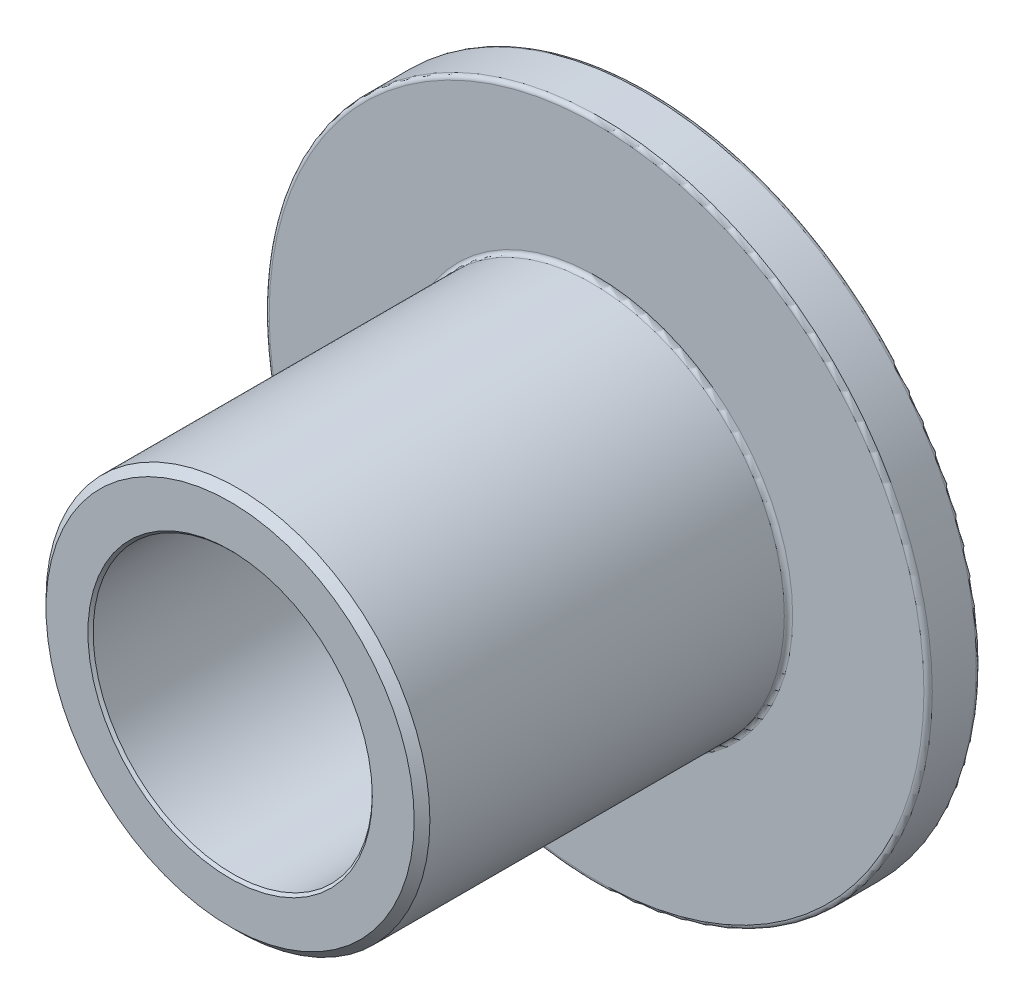
ISO-10303-21;
HEADER;
FILE_DESCRIPTION(('STEP AP214'),'2;1');
FILE_NAME('part.step','',(''),(''),'','','');
FILE_SCHEMA(('AUTOMOTIVE_DESIGN { 1 0 10303 214 1 1 1 1 }'));
ENDSEC;
DATA;
#1=APPLICATION_CONTEXT('core data for automotive mechanical design processes');
#2=APPLICATION_PROTOCOL_DEFINITION('international standard','automotive_design',2000,#1);
#3=PRODUCT_CONTEXT('',#1,'mechanical');
#4=PRODUCT('Part','Part','',(#3));
#5=PRODUCT_RELATED_PRODUCT_CATEGORY('part','',(#4));
#6=PRODUCT_DEFINITION_FORMATION('','',#4);
#7=PRODUCT_DEFINITION_CONTEXT('part definition',#1,'design');
#8=PRODUCT_DEFINITION('design','',#6,#7);
#9=PRODUCT_DEFINITION_SHAPE('','',#8);
#10=(LENGTH_UNIT() NAMED_UNIT(*) SI_UNIT(.MILLI.,.METRE.));
#11=(NAMED_UNIT(*) PLANE_ANGLE_UNIT() SI_UNIT($,.RADIAN.));
#12=(NAMED_UNIT(*) SI_UNIT($,.STERADIAN.) SOLID_ANGLE_UNIT());
#13=UNCERTAINTY_MEASURE_WITH_UNIT(LENGTH_MEASURE(1.E-05),#10,'distance_accuracy_value','');
#14=(GEOMETRIC_REPRESENTATION_CONTEXT(3) GLOBAL_UNCERTAINTY_ASSIGNED_CONTEXT((#13)) GLOBAL_UNIT_ASSIGNED_CONTEXT((#10,
#11,#12)) REPRESENTATION_CONTEXT('',''));
#15=CARTESIAN_POINT('',(0.,0.,0.));
#16=DIRECTION('',(0.,0.,1.));
#17=DIRECTION('',(1.,0.,0.));
#18=AXIS2_PLACEMENT_3D('',#15,#16,#17);
#19=CARTESIAN_POINT('',(0.,-2.,-3.));
#20=DIRECTION('',(0.,0.,-1.));
#21=DIRECTION('',(-1.,0.,0.));
#22=AXIS2_PLACEMENT_3D('',#19,#20,#21);
#23=PLANE('',#22);
#24=CARTESIAN_POINT('',(0.,0.,-3.));
#25=DIRECTION('',(0.,0.,-1.));
#26=DIRECTION('',(-1.,0.,0.));
#27=AXIS2_PLACEMENT_3D('',#24,#25,#26);
#28=CIRCLE('',#27,4.69);
#29=CARTESIAN_POINT('',(-4.69,0.,-3.));
#30=VERTEX_POINT('',#29);
#31=EDGE_CURVE('E47',#30,#30,#28,.T.);
#32=ORIENTED_EDGE('',*,*,#31,.T.);
#33=EDGE_LOOP('',(#32));
#34=FACE_BOUND('',#33,.T.);
#35=CARTESIAN_POINT('',(0.,0.,-3.));
#36=DIRECTION('',(0.,0.,-1.));
#37=DIRECTION('',(-1.,0.,0.));
#38=AXIS2_PLACEMENT_3D('',#35,#36,#37);
#39=CIRCLE('',#38,2.0375);
#40=CARTESIAN_POINT('',(-2.0375,0.,-3.));
#41=VERTEX_POINT('',#40);
#42=EDGE_CURVE('E67',#41,#41,#39,.F.);
#43=ORIENTED_EDGE('',*,*,#42,.T.);
#44=EDGE_LOOP('',(#43));
#45=FACE_BOUND('',#44,.T.);
#46=ADVANCED_FACE('F32',(#34,#45),#23,.T.);
#47=CARTESIAN_POINT('',(0.,0.,3.));
#48=DIRECTION('',(0.,0.,1.));
#49=DIRECTION('',(1.,0.,0.));
#50=AXIS2_PLACEMENT_3D('',#47,#48,#49);
#51=CYLINDRICAL_SURFACE('',#50,4.75);
#52=CARTESIAN_POINT('',(0.,0.,-2.94));
#53=DIRECTION('',(0.,0.,-1.));
#54=DIRECTION('',(-1.,0.,0.));
#55=AXIS2_PLACEMENT_3D('',#52,#53,#54);
#56=CIRCLE('',#55,4.75);
#57=CARTESIAN_POINT('',(-4.75,0.,-2.94));
#58=VERTEX_POINT('',#57);
#59=EDGE_CURVE('E52',#58,#58,#56,.F.);
#60=ORIENTED_EDGE('',*,*,#59,.T.);
#61=EDGE_LOOP('',(#60));
#62=FACE_BOUND('',#61,.T.);
#63=CARTESIAN_POINT('',(0.,0.,-2.31));
#64=DIRECTION('',(0.,0.,1.));
#65=DIRECTION('',(1.,0.,0.));
#66=AXIS2_PLACEMENT_3D('',#63,#64,#65);
#67=CIRCLE('',#66,4.75);
#68=CARTESIAN_POINT('',(4.75,0.,-2.31));
#69=VERTEX_POINT('',#68);
#70=EDGE_CURVE('E55',#69,#69,#67,.F.);
#71=ORIENTED_EDGE('',*,*,#70,.T.);
#72=EDGE_LOOP('',(#71));
#73=FACE_BOUND('',#72,.T.);
#74=ADVANCED_FACE('F97',(#62,#73),#51,.T.);
#75=CARTESIAN_POINT('',(0.,-4.75,-2.25));
#76=DIRECTION('',(0.,0.,1.));
#77=DIRECTION('',(1.,0.,0.));
#78=AXIS2_PLACEMENT_3D('',#75,#76,#77);
#79=PLANE('',#78);
#80=CARTESIAN_POINT('',(0.,0.,-2.25));
#81=DIRECTION('',(0.,0.,1.));
#82=DIRECTION('',(1.,0.,0.));
#83=AXIS2_PLACEMENT_3D('',#80,#81,#82);
#84=CIRCLE('',#83,2.81);
#85=CARTESIAN_POINT('',(2.81,0.,-2.25));
#86=VERTEX_POINT('',#85);
#87=EDGE_CURVE('E10',#86,#86,#84,.F.);
#88=ORIENTED_EDGE('',*,*,#87,.T.);
#89=EDGE_LOOP('',(#88));
#90=FACE_BOUND('',#89,.T.);
#91=CARTESIAN_POINT('',(0.,0.,-2.25));
#92=DIRECTION('',(0.,0.,1.));
#93=DIRECTION('',(1.,0.,0.));
#94=AXIS2_PLACEMENT_3D('',#91,#92,#93);
#95=CIRCLE('',#94,4.69);
#96=CARTESIAN_POINT('',(4.69,0.,-2.25));
#97=VERTEX_POINT('',#96);
#98=EDGE_CURVE('E39',#97,#97,#95,.T.);
#99=ORIENTED_EDGE('',*,*,#98,.T.);
#100=EDGE_LOOP('',(#99));
#101=FACE_BOUND('',#100,.T.);
#102=ADVANCED_FACE('F102',(#90,#101),#79,.T.);
#103=CARTESIAN_POINT('',(0.,0.,3.));
#104=DIRECTION('',(0.,0.,1.));
#105=DIRECTION('',(1.,0.,0.));
#106=AXIS2_PLACEMENT_3D('',#103,#104,#105);
#107=CYLINDRICAL_SURFACE('',#106,2.75);
#108=CARTESIAN_POINT('',(0.,0.,-2.19));
#109=DIRECTION('',(0.,0.,1.));
#110=DIRECTION('',(1.,0.,0.));
#111=AXIS2_PLACEMENT_3D('',#108,#109,#110);
#112=CIRCLE('',#111,2.75);
#113=CARTESIAN_POINT('',(2.75,0.,-2.19));
#114=VERTEX_POINT('',#113);
#115=EDGE_CURVE('E43',#114,#114,#112,.T.);
#116=ORIENTED_EDGE('',*,*,#115,.T.);
#117=EDGE_LOOP('',(#116));
#118=FACE_BOUND('',#117,.T.);
#119=CARTESIAN_POINT('',(0.,0.,2.8875));
#120=DIRECTION('',(0.,0.,1.));
#121=DIRECTION('',(1.,0.,0.));
#122=AXIS2_PLACEMENT_3D('',#119,#120,#121);
#123=CIRCLE('',#122,2.75);
#124=CARTESIAN_POINT('',(2.75,0.,2.8875));
#125=VERTEX_POINT('',#124);
#126=EDGE_CURVE('E70',#125,#125,#123,.F.);
#127=ORIENTED_EDGE('',*,*,#126,.T.);
#128=EDGE_LOOP('',(#127));
#129=FACE_BOUND('',#128,.T.);
#130=ADVANCED_FACE('F109',(#118,#129),#107,.T.);
#131=CARTESIAN_POINT('',(0.,-2.75,3.));
#132=DIRECTION('',(0.,0.,1.));
#133=DIRECTION('',(1.,0.,0.));
#134=AXIS2_PLACEMENT_3D('',#131,#132,#133);
#135=PLANE('',#134);
#136=CARTESIAN_POINT('',(0.,0.,3.));
#137=DIRECTION('',(0.,0.,1.));
#138=DIRECTION('',(1.,0.,0.));
#139=AXIS2_PLACEMENT_3D('',#136,#137,#138);
#140=CIRCLE('',#139,2.0375);
#141=CARTESIAN_POINT('',(2.0375,0.,3.));
#142=VERTEX_POINT('',#141);
#143=EDGE_CURVE('E58',#142,#142,#140,.F.);
#144=ORIENTED_EDGE('',*,*,#143,.T.);
#145=EDGE_LOOP('',(#144));
#146=FACE_BOUND('',#145,.T.);
#147=CARTESIAN_POINT('',(0.,0.,3.));
#148=DIRECTION('',(0.,0.,1.));
#149=DIRECTION('',(1.,0.,0.));
#150=AXIS2_PLACEMENT_3D('',#147,#148,#149);
#151=CIRCLE('',#150,2.6375);
#152=CARTESIAN_POINT('',(2.6375,0.,3.));
#153=VERTEX_POINT('',#152);
#154=EDGE_CURVE('E73',#153,#153,#151,.T.);
#155=ORIENTED_EDGE('',*,*,#154,.T.);
#156=EDGE_LOOP('',(#155));
#157=FACE_BOUND('',#156,.T.);
#158=ADVANCED_FACE('F77',(#146,#157),#135,.T.);
#159=CARTESIAN_POINT('',(0.,0.,3.));
#160=DIRECTION('',(0.,0.,1.));
#161=DIRECTION('',(1.,0.,0.));
#162=AXIS2_PLACEMENT_3D('',#159,#160,#161);
#163=CYLINDRICAL_SURFACE('',#162,2.);
#164=CARTESIAN_POINT('',(0.,0.,-2.9625));
#165=DIRECTION('',(0.,0.,-1.));
#166=DIRECTION('',(-1.,0.,0.));
#167=AXIS2_PLACEMENT_3D('',#164,#165,#166);
#168=CIRCLE('',#167,2.);
#169=CARTESIAN_POINT('',(-2.,0.,-2.9625));
#170=VERTEX_POINT('',#169);
#171=EDGE_CURVE('E61',#170,#170,#168,.T.);
#172=ORIENTED_EDGE('',*,*,#171,.T.);
#173=EDGE_LOOP('',(#172));
#174=FACE_BOUND('',#173,.T.);
#175=CARTESIAN_POINT('',(0.,0.,2.9625));
#176=DIRECTION('',(0.,0.,1.));
#177=DIRECTION('',(1.,0.,0.));
#178=AXIS2_PLACEMENT_3D('',#175,#176,#177);
#179=CIRCLE('',#178,2.);
#180=CARTESIAN_POINT('',(2.,0.,2.9625));
#181=VERTEX_POINT('',#180);
#182=EDGE_CURVE('E64',#181,#181,#179,.T.);
#183=ORIENTED_EDGE('',*,*,#182,.T.);
#184=EDGE_LOOP('',(#183));
#185=FACE_BOUND('',#184,.T.);
#186=ADVANCED_FACE('F82',(#174,#185),#163,.F.);
#187=CARTESIAN_POINT('',(0.,0.,3.));
#188=DIRECTION('',(0.,0.,-1.));
#189=DIRECTION('',(-1.,0.,0.));
#190=AXIS2_PLACEMENT_3D('',#187,#188,#189);
#191=CONICAL_SURFACE('',#190,2.6375,0.785398163397448);
#192=ORIENTED_EDGE('',*,*,#126,.F.);
#193=EDGE_LOOP('',(#192));
#194=FACE_BOUND('',#193,.T.);
#195=ORIENTED_EDGE('',*,*,#154,.F.);
#196=EDGE_LOOP('',(#195));
#197=FACE_BOUND('',#196,.T.);
#198=ADVANCED_FACE('F79',(#194,#197),#191,.T.);
#199=CARTESIAN_POINT('',(0.,0.,-3.));
#200=DIRECTION('',(0.,0.,-1.));
#201=DIRECTION('',(-1.,0.,0.));
#202=AXIS2_PLACEMENT_3D('',#199,#200,#201);
#203=CONICAL_SURFACE('',#202,2.0375,0.785398163397448);
#204=ORIENTED_EDGE('',*,*,#171,.F.);
#205=EDGE_LOOP('',(#204));
#206=FACE_BOUND('',#205,.T.);
#207=ORIENTED_EDGE('',*,*,#42,.F.);
#208=EDGE_LOOP('',(#207));
#209=FACE_BOUND('',#208,.T.);
#210=ADVANCED_FACE('F81',(#206,#209),#203,.F.);
#211=CARTESIAN_POINT('',(0.,0.,2.9625));
#212=DIRECTION('',(0.,0.,1.));
#213=DIRECTION('',(1.,0.,0.));
#214=AXIS2_PLACEMENT_3D('',#211,#212,#213);
#215=CONICAL_SURFACE('',#214,2.,0.785398163397425);
#216=ORIENTED_EDGE('',*,*,#143,.F.);
#217=EDGE_LOOP('',(#216));
#218=FACE_BOUND('',#217,.T.);
#219=ORIENTED_EDGE('',*,*,#182,.F.);
#220=EDGE_LOOP('',(#219));
#221=FACE_BOUND('',#220,.T.);
#222=ADVANCED_FACE('F89',(#218,#221),#215,.F.);
#223=CARTESIAN_POINT('',(0.,0.,-2.94));
#224=DIRECTION('',(0.,0.,-1.));
#225=DIRECTION('',(-1.,0.,0.));
#226=AXIS2_PLACEMENT_3D('',#223,#224,#225);
#227=TOROIDAL_SURFACE('',#226,4.69,0.06);
#228=ORIENTED_EDGE('',*,*,#31,.F.);
#229=EDGE_LOOP('',(#228));
#230=FACE_BOUND('',#229,.T.);
#231=ORIENTED_EDGE('',*,*,#59,.F.);
#232=EDGE_LOOP('',(#231));
#233=FACE_BOUND('',#232,.T.);
#234=ADVANCED_FACE('F121',(#230,#233),#227,.T.);
#235=CARTESIAN_POINT('',(0.,0.,-2.19));
#236=DIRECTION('',(0.,0.,1.));
#237=DIRECTION('',(1.,0.,0.));
#238=AXIS2_PLACEMENT_3D('',#235,#236,#237);
#239=TOROIDAL_SURFACE('',#238,2.81,0.06);
#240=ORIENTED_EDGE('',*,*,#87,.F.);
#241=EDGE_LOOP('',(#240));
#242=FACE_BOUND('',#241,.T.);
#243=ORIENTED_EDGE('',*,*,#115,.F.);
#244=EDGE_LOOP('',(#243));
#245=FACE_BOUND('',#244,.T.);
#246=ADVANCED_FACE('F128',(#242,#245),#239,.F.);
#247=CARTESIAN_POINT('',(0.,0.,-2.31));
#248=DIRECTION('',(0.,0.,1.));
#249=DIRECTION('',(1.,0.,0.));
#250=AXIS2_PLACEMENT_3D('',#247,#248,#249);
#251=TOROIDAL_SURFACE('',#250,4.69,0.06);
#252=ORIENTED_EDGE('',*,*,#70,.F.);
#253=EDGE_LOOP('',(#252));
#254=FACE_BOUND('',#253,.T.);
#255=ORIENTED_EDGE('',*,*,#98,.F.);
#256=EDGE_LOOP('',(#255));
#257=FACE_BOUND('',#256,.T.);
#258=ADVANCED_FACE('F34',(#254,#257),#251,.T.);
#259=CLOSED_SHELL('',(#46,#74,#102,#130,#158,#186,#198,#210,#222,#234,#246,#258));
#260=MANIFOLD_SOLID_BREP('B2',#259);
#261=ADVANCED_BREP_SHAPE_REPRESENTATION('',(#18,#260),#14);
#262=SHAPE_DEFINITION_REPRESENTATION(#9,#261);
ENDSEC;
END-ISO-10303-21;
